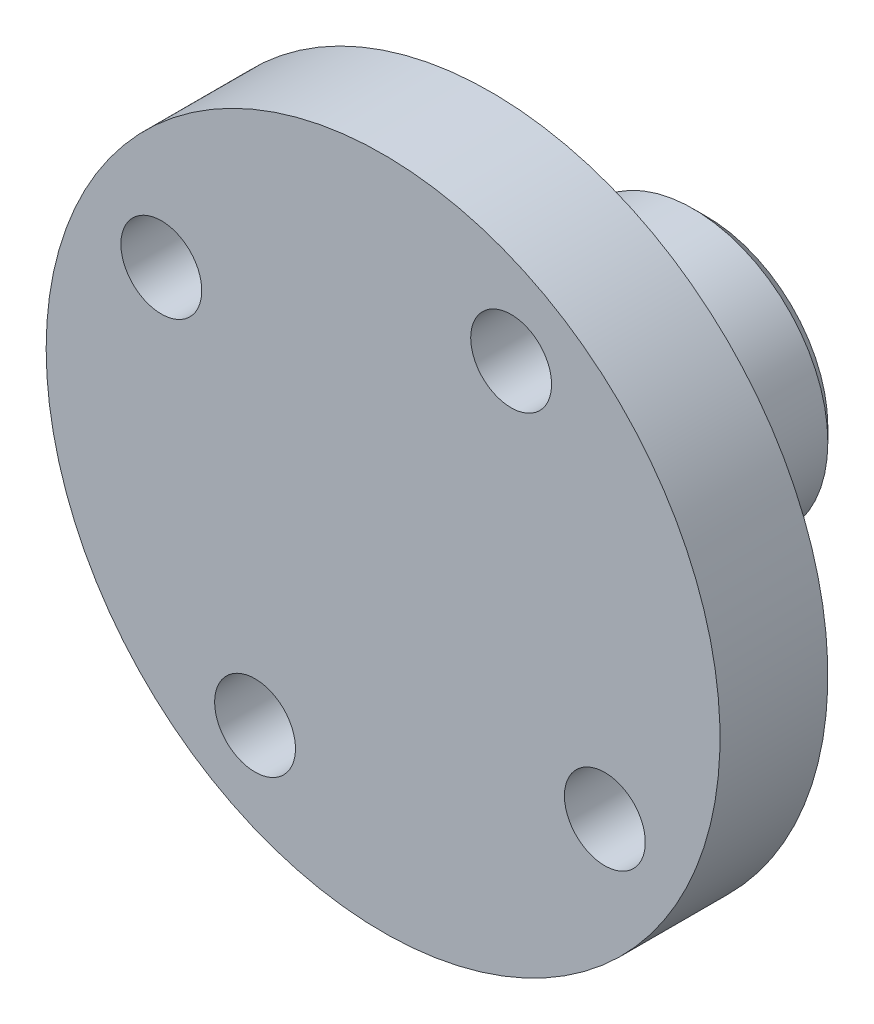
ISO-10303-21;
HEADER;
FILE_DESCRIPTION(('STEP AP214'),'2;1');
FILE_NAME('part.step','',(''),(''),'','','');
FILE_SCHEMA(('AUTOMOTIVE_DESIGN { 1 0 10303 214 1 1 1 1 }'));
ENDSEC;
DATA;
#1=APPLICATION_CONTEXT('core data for automotive mechanical design processes');
#2=APPLICATION_PROTOCOL_DEFINITION('international standard','automotive_design',2000,#1);
#3=PRODUCT_CONTEXT('',#1,'mechanical');
#4=PRODUCT('Part','Part','',(#3));
#5=PRODUCT_RELATED_PRODUCT_CATEGORY('part','',(#4));
#6=PRODUCT_DEFINITION_FORMATION('','',#4);
#7=PRODUCT_DEFINITION_CONTEXT('part definition',#1,'design');
#8=PRODUCT_DEFINITION('design','',#6,#7);
#9=PRODUCT_DEFINITION_SHAPE('','',#8);
#10=(LENGTH_UNIT() NAMED_UNIT(*) SI_UNIT(.MILLI.,.METRE.));
#11=(NAMED_UNIT(*) PLANE_ANGLE_UNIT() SI_UNIT($,.RADIAN.));
#12=(NAMED_UNIT(*) SI_UNIT($,.STERADIAN.) SOLID_ANGLE_UNIT());
#13=UNCERTAINTY_MEASURE_WITH_UNIT(LENGTH_MEASURE(1.E-05),#10,'distance_accuracy_value','');
#14=(GEOMETRIC_REPRESENTATION_CONTEXT(3) GLOBAL_UNCERTAINTY_ASSIGNED_CONTEXT((#13)) GLOBAL_UNIT_ASSIGNED_CONTEXT((#10,
#11,#12)) REPRESENTATION_CONTEXT('',''));
#15=CARTESIAN_POINT('',(0.,0.,0.));
#16=DIRECTION('',(0.,0.,1.));
#17=DIRECTION('',(1.,0.,0.));
#18=AXIS2_PLACEMENT_3D('',#15,#16,#17);
#19=CARTESIAN_POINT('',(12.5,0.,0.));
#20=DIRECTION('',(0.,0.,-1.));
#21=DIRECTION('',(-1.,0.,0.));
#22=AXIS2_PLACEMENT_3D('',#19,#20,#21);
#23=PLANE('',#22);
#24=CARTESIAN_POINT('',(4.75000000000001,8.22724133595215,0.));
#25=DIRECTION('',(0.,0.,-1.));
#26=DIRECTION('',(-1.,0.,0.));
#27=AXIS2_PLACEMENT_3D('',#24,#25,#26);
#28=CIRCLE('',#27,1.5);
#29=CARTESIAN_POINT('',(3.25,8.22724133595215,0.));
#30=VERTEX_POINT('',#29);
#31=EDGE_CURVE('E109',#30,#30,#28,.F.);
#32=ORIENTED_EDGE('',*,*,#31,.F.);
#33=EDGE_LOOP('',(#32));
#34=FACE_BOUND('',#33,.T.);
#35=CARTESIAN_POINT('',(-4.75000000000001,-8.22724133595215,0.));
#36=DIRECTION('',(0.,0.,-1.));
#37=DIRECTION('',(-1.,0.,0.));
#38=AXIS2_PLACEMENT_3D('',#35,#36,#37);
#39=CIRCLE('',#38,1.5);
#40=CARTESIAN_POINT('',(-6.25000000000001,-8.22724133595215,0.));
#41=VERTEX_POINT('',#40);
#42=EDGE_CURVE('E113',#41,#41,#39,.F.);
#43=ORIENTED_EDGE('',*,*,#42,.F.);
#44=EDGE_LOOP('',(#43));
#45=FACE_BOUND('',#44,.T.);
#46=CARTESIAN_POINT('',(-8.22724133595215,4.75,0.));
#47=DIRECTION('',(0.,0.,-1.));
#48=DIRECTION('',(-1.,0.,0.));
#49=AXIS2_PLACEMENT_3D('',#46,#47,#48);
#50=CIRCLE('',#49,1.5);
#51=CARTESIAN_POINT('',(-9.72724133595215,4.75,0.));
#52=VERTEX_POINT('',#51);
#53=EDGE_CURVE('E117',#52,#52,#50,.F.);
#54=ORIENTED_EDGE('',*,*,#53,.F.);
#55=EDGE_LOOP('',(#54));
#56=FACE_BOUND('',#55,.T.);
#57=CARTESIAN_POINT('',(8.22724133595215,-4.75000000000001,0.));
#58=DIRECTION('',(0.,0.,-1.));
#59=DIRECTION('',(-1.,0.,0.));
#60=AXIS2_PLACEMENT_3D('',#57,#58,#59);
#61=CIRCLE('',#60,1.5);
#62=CARTESIAN_POINT('',(6.72724133595215,-4.75000000000001,0.));
#63=VERTEX_POINT('',#62);
#64=EDGE_CURVE('E121',#63,#63,#61,.F.);
#65=ORIENTED_EDGE('',*,*,#64,.F.);
#66=EDGE_LOOP('',(#65));
#67=FACE_BOUND('',#66,.T.);
#68=CARTESIAN_POINT('',(0.,0.,0.));
#69=DIRECTION('',(0.,0.,-1.));
#70=DIRECTION('',(-1.,0.,0.));
#71=AXIS2_PLACEMENT_3D('',#68,#69,#70);
#72=CIRCLE('',#71,12.5);
#73=CARTESIAN_POINT('',(-12.5,0.,0.));
#74=VERTEX_POINT('',#73);
#75=EDGE_CURVE('E124',#74,#74,#72,.T.);
#76=ORIENTED_EDGE('',*,*,#75,.F.);
#77=EDGE_LOOP('',(#76));
#78=FACE_BOUND('',#77,.T.);
#79=ADVANCED_FACE('F34',(#34,#45,#56,#67,#78),#23,.F.);
#80=CARTESIAN_POINT('',(4.,0.,-4.));
#81=DIRECTION('',(0.,0.,1.));
#82=DIRECTION('',(1.,0.,0.));
#83=AXIS2_PLACEMENT_3D('',#80,#81,#82);
#84=PLANE('',#83);
#85=CARTESIAN_POINT('',(0.,0.,-4.));
#86=DIRECTION('',(0.,0.,-1.));
#87=DIRECTION('',(-1.,0.,0.));
#88=AXIS2_PLACEMENT_3D('',#85,#86,#87);
#89=CIRCLE('',#88,4.);
#90=CARTESIAN_POINT('',(-4.,0.,-4.));
#91=VERTEX_POINT('',#90);
#92=EDGE_CURVE('E45',#91,#91,#89,.T.);
#93=ORIENTED_EDGE('',*,*,#92,.T.);
#94=EDGE_LOOP('',(#93));
#95=FACE_BOUND('',#94,.T.);
#96=ADVANCED_FACE('F97',(#95),#84,.F.);
#97=CARTESIAN_POINT('',(0.,0.,0.));
#98=DIRECTION('',(0.,0.,-1.));
#99=DIRECTION('',(-1.,0.,0.));
#100=AXIS2_PLACEMENT_3D('',#97,#98,#99);
#101=CYLINDRICAL_SURFACE('',#100,4.);
#102=CARTESIAN_POINT('',(-4.,0.,-6.5));
#103=CARTESIAN_POINT('',(-4.00000217456151,0.0812350589378529,-6.49999709769689));
#104=CARTESIAN_POINT('',(-3.99750379283184,0.162450241781792,-6.50661976024838));
#105=CARTESIAN_POINT('',(-3.98778696006928,0.322453452352361,-6.53282819526993));
#106=CARTESIAN_POINT('',(-3.98056918893993,0.401241827987616,-6.55241210047057));
#107=CARTESIAN_POINT('',(-3.96218832391545,0.554060784990879,-6.60375300177176));
#108=CARTESIAN_POINT('',(-3.9510328434944,0.628100224162277,-6.63548651682179));
#109=CARTESIAN_POINT('',(-3.92588767765353,0.769799310160253,-6.71010641301582));
#110=CARTESIAN_POINT('',(-3.91189723227548,0.837457239177879,-6.75299578554416));
#111=CARTESIAN_POINT('',(-3.88186246971217,0.967346417045826,-6.85061253107091));
#112=CARTESIAN_POINT('',(-3.86576002583566,1.02927073015119,-6.9057302622594));
#113=CARTESIAN_POINT('',(-3.83360220871327,1.14324421474363,-7.02541043465884));
#114=CARTESIAN_POINT('',(-3.81754685135033,1.19529036359203,-7.08997575608787));
#115=CARTESIAN_POINT('',(-3.78662470617731,1.28998202215985,-7.22971746752321));
#116=CARTESIAN_POINT('',(-3.77182648820818,1.3321939319576,-7.30520436654582));
#117=CARTESIAN_POINT('',(-3.74599860237433,1.40318646334084,-7.46284835416852));
#118=CARTESIAN_POINT('',(-3.73496742975881,1.43197244961239,-7.5450027631551));
#119=CARTESIAN_POINT('',(-3.71854412824136,1.47408431017549,-7.7101167402582));
#120=CARTESIAN_POINT('',(-3.71293924350838,1.48799593218558,-7.79290503843544));
#121=CARTESIAN_POINT('',(-3.70738061461215,1.50179556531648,-7.95981615799384));
#122=CARTESIAN_POINT('',(-3.70742453659304,1.50168936802631,-8.04393841387447));
#123=CARTESIAN_POINT('',(-3.71297511632054,1.48790429610018,-8.20576952521296));
#124=CARTESIAN_POINT('',(-3.71815468871121,1.47503808509004,-8.28356090604418));
#125=CARTESIAN_POINT('',(-3.73284938059529,1.4374416786833,-8.43578715040532));
#126=CARTESIAN_POINT('',(-3.74236515298863,1.41270969663258,-8.51022150661388));
#127=CARTESIAN_POINT('',(-3.76485702190253,1.35163748571904,-8.65527706772823));
#128=CARTESIAN_POINT('',(-3.77789517988166,1.31508648737101,-8.7257994861213));
#129=CARTESIAN_POINT('',(-3.80594210139319,1.23156073762698,-8.85994573759097));
#130=CARTESIAN_POINT('',(-3.82095154457158,1.18458238728897,-8.9235671775197));
#131=CARTESIAN_POINT('',(-3.85248038859113,1.07781780766549,-9.04660366365088));
#132=CARTESIAN_POINT('',(-3.8690334745567,1.01738298716956,-9.10544864074809));
#133=CARTESIAN_POINT('',(-3.90091728164085,0.887312590819021,-9.2123379662058));
#134=CARTESIAN_POINT('',(-3.91624781465952,0.817675603497364,-9.26038065460567));
#135=CARTESIAN_POINT('',(-3.9442639480908,0.66972343699242,-9.34493039706252));
#136=CARTESIAN_POINT('',(-3.95690498259616,0.591290713844719,-9.38124758122106));
#137=CARTESIAN_POINT('',(-3.97778718326962,0.428836850524583,-9.43998260427004));
#138=CARTESIAN_POINT('',(-3.98603030341493,0.344818210845767,-9.46240661656112));
#139=CARTESIAN_POINT('',(-3.99684443228065,0.178375243148665,-9.49162278754194));
#140=CARTESIAN_POINT('',(-3.99969369025686,0.0961036195622094,-9.49918260638251));
#141=CARTESIAN_POINT('',(-4.00025893700126,-0.0685724752550241,-9.50069106389992));
#142=CARTESIAN_POINT('',(-3.99797606386863,-0.150976912983373,-9.49464272031678));
#143=CARTESIAN_POINT('',(-3.98871709772643,-0.310262048561859,-9.46968995769133));
#144=CARTESIAN_POINT('',(-3.98192470962305,-0.387233328007336,-9.45128845626292));
#145=CARTESIAN_POINT('',(-3.96451477091717,-0.536941754957221,-9.40281392745268));
#146=CARTESIAN_POINT('',(-3.9538967228203,-0.609678350347535,-9.37273938205197));
#147=CARTESIAN_POINT('',(-3.92949624407681,-0.751247765110156,-9.30081358756053));
#148=CARTESIAN_POINT('',(-3.91563000209348,-0.819903083557795,-9.25864227077662));
#149=CARTESIAN_POINT('',(-3.88626671564664,-0.949392711726625,-9.16408189682844));
#150=CARTESIAN_POINT('',(-3.87076907009516,-1.01022412027045,-9.11168906745485));
#151=CARTESIAN_POINT('',(-3.83873329490989,-1.12603079874454,-8.99459587787573));
#152=CARTESIAN_POINT('',(-3.82218696503729,-1.18046154123569,-8.9293578172273));
#153=CARTESIAN_POINT('',(-3.79078815746854,-1.27771050031903,-8.79034861529234));
#154=CARTESIAN_POINT('',(-3.77593583194399,-1.32052767414518,-8.7165767086115));
#155=CARTESIAN_POINT('',(-3.74966829822463,-1.39337773518998,-8.56198401322769));
#156=CARTESIAN_POINT('',(-3.73826760328493,-1.42335685446918,-8.48113525408957));
#157=CARTESIAN_POINT('',(-3.72054032891005,-1.46907883466889,-8.31499023631218));
#158=CARTESIAN_POINT('',(-3.71421061057491,-1.48483050305535,-8.22969676380188));
#159=CARTESIAN_POINT('',(-3.70775894792573,-1.50086347097839,-8.06298384045889));
#160=CARTESIAN_POINT('',(-3.70726444523341,-1.50207331495837,-7.98166736828311));
#161=CARTESIAN_POINT('',(-3.71158412745292,-1.49136715641593,-7.82005468372383));
#162=CARTESIAN_POINT('',(-3.71639780898899,-1.47945239850124,-7.73975837532842));
#163=CARTESIAN_POINT('',(-3.73048141585432,-1.44355815630242,-7.58495277328345));
#164=CARTESIAN_POINT('',(-3.73961085376663,-1.41995798316524,-7.51034165375466));
#165=CARTESIAN_POINT('',(-3.76121548297845,-1.3616969677992,-7.36609449150558));
#166=CARTESIAN_POINT('',(-3.77369151995215,-1.32703332944945,-7.29645971192986));
#167=CARTESIAN_POINT('',(-3.80139723903964,-1.24552075938154,-7.16017321030237));
#168=CARTESIAN_POINT('',(-3.81673698440964,-1.1981283280301,-7.09386920320009));
#169=CARTESIAN_POINT('',(-3.84806246757177,-1.09334485729906,-6.9698584390288));
#170=CARTESIAN_POINT('',(-3.86404840943145,-1.03595064012808,-6.91215442521325));
#171=CARTESIAN_POINT('',(-3.89590424609881,-0.909080396784622,-6.80379804417816));
#172=CARTESIAN_POINT('',(-3.91172104900645,-0.839118644212991,-6.75369624656533));
#173=CARTESIAN_POINT('',(-3.9405451445703,-0.691213223200819,-6.66597734472344));
#174=CARTESIAN_POINT('',(-3.95355221851559,-0.61326893409062,-6.62836121226363));
#175=CARTESIAN_POINT('',(-3.9757429260668,-0.447999082002311,-6.56562317095167));
#176=CARTESIAN_POINT('',(-3.98473657158356,-0.360413422234208,-6.5411129353981));
#177=CARTESIAN_POINT('',(-3.99686242179587,-0.181875733606382,-6.50830704007932));
#178=CARTESIAN_POINT('',(-3.99999756603967,-0.090925416364859,-6.50000324851268));
#179=CARTESIAN_POINT('',(-4.,0.,-6.5));
#180=B_SPLINE_CURVE_WITH_KNOTS('',3,(#102,#103,#104,#105,#106,#107,#108,#109,#110,#111,#112,
#113,#114,#115,#116,#117,#118,#119,#120,#121,#122,#123,#124,#125,#126,#127,#128,#129,#130,#131,
#132,#133,#134,#135,#136,#137,#138,#139,#140,#141,#142,#143,#144,#145,#146,#147,#148,#149,#150,
#151,#152,#153,#154,#155,#156,#157,#158,#159,#160,#161,#162,#163,#164,#165,#166,#167,#168,#169,
#170,#171,#172,#173,#174,#175,#176,#177,#178,#179),.UNSPECIFIED.,.T.,.F.,(4,2,2,2,2,2,2,2,2,2,2,
2,2,2,2,2,2,2,2,2,2,2,2,2,2,2,2,2,2,2,2,2,2,2,2,2,2,2,4),(0.,0.24336980156056,0.48670454953046,
0.729571369213573,0.97250337960949,1.22473618582715,1.47704604925622,1.73896674501659,
2.00078269352134,2.25185874416901,2.50283106079707,2.73878345119971,2.97477138060589,
3.21522408387018,3.45575990744259,3.71246153335813,3.96920257905066,4.22991375286075,
4.49050899698846,4.73725019635926,4.98393668390521,5.2211443792384,5.45838293254454,
5.702592218596,5.94689180019868,6.20536519455658,6.46386178920141,6.72343066727204,
6.98283874956507,7.22558763480252,7.46831350211259,7.70363142426534,7.93900886656507,
8.18672471884271,8.43451941997062,8.69572329654039,8.95694749805102,9.22948515032042,
9.50188601796128),.UNSPECIFIED.);
#181=CARTESIAN_POINT('',(-4.,0.,-6.5));
#182=VERTEX_POINT('',#181);
#183=EDGE_CURVE('E87',#182,#182,#180,.T.);
#184=ORIENTED_EDGE('',*,*,#183,.T.);
#185=EDGE_LOOP('',(#184));
#186=FACE_BOUND('',#185,.T.);
#187=CARTESIAN_POINT('',(4.,0.,-9.5));
#188=CARTESIAN_POINT('',(4.00000217456151,0.0812350589378529,-9.50000290230311));
#189=CARTESIAN_POINT('',(3.99750379283184,0.162450241781792,-9.49338023975162));
#190=CARTESIAN_POINT('',(3.98778696006928,0.322453452352361,-9.46717180473007));
#191=CARTESIAN_POINT('',(3.98056918893993,0.401241827987616,-9.44758789952943));
#192=CARTESIAN_POINT('',(3.96218832391545,0.554060784990879,-9.39624699822824));
#193=CARTESIAN_POINT('',(3.9510328434944,0.628100224162277,-9.36451348317821));
#194=CARTESIAN_POINT('',(3.92588767765353,0.769799310160253,-9.28989358698418));
#195=CARTESIAN_POINT('',(3.91189723227548,0.837457239177879,-9.24700421445585));
#196=CARTESIAN_POINT('',(3.88186246971217,0.967346417045826,-9.14938746892909));
#197=CARTESIAN_POINT('',(3.86576002583566,1.02927073015119,-9.0942697377406));
#198=CARTESIAN_POINT('',(3.83360220871327,1.14324421474363,-8.97458956534116));
#199=CARTESIAN_POINT('',(3.81754685135033,1.19529036359203,-8.91002424391213));
#200=CARTESIAN_POINT('',(3.78662470617731,1.28998202215985,-8.77028253247679));
#201=CARTESIAN_POINT('',(3.77182648820818,1.3321939319576,-8.69479563345418));
#202=CARTESIAN_POINT('',(3.74599860237433,1.40318646334084,-8.53715164583148));
#203=CARTESIAN_POINT('',(3.73496742975881,1.43197244961239,-8.4549972368449));
#204=CARTESIAN_POINT('',(3.71854412824136,1.47408431017549,-8.2898832597418));
#205=CARTESIAN_POINT('',(3.71293924350838,1.48799593218558,-8.20709496156456));
#206=CARTESIAN_POINT('',(3.70738061461215,1.50179556531648,-8.04018384200616));
#207=CARTESIAN_POINT('',(3.70742453659304,1.50168936802631,-7.95606158612553));
#208=CARTESIAN_POINT('',(3.71297511632054,1.48790429610018,-7.79423047478705));
#209=CARTESIAN_POINT('',(3.71815468871121,1.47503808509004,-7.71643909395582));
#210=CARTESIAN_POINT('',(3.73284938059529,1.4374416786833,-7.56421284959468));
#211=CARTESIAN_POINT('',(3.74236515298863,1.41270969663258,-7.48977849338612));
#212=CARTESIAN_POINT('',(3.76485702190253,1.35163748571904,-7.34472293227177));
#213=CARTESIAN_POINT('',(3.77789517988166,1.31508648737101,-7.2742005138787));
#214=CARTESIAN_POINT('',(3.80594210139319,1.23156073762698,-7.14005426240903));
#215=CARTESIAN_POINT('',(3.82095154457158,1.18458238728897,-7.0764328224803));
#216=CARTESIAN_POINT('',(3.85248038859113,1.07781780766549,-6.95339633634912));
#217=CARTESIAN_POINT('',(3.8690334745567,1.01738298716956,-6.89455135925191));
#218=CARTESIAN_POINT('',(3.90091728164085,0.887312590819021,-6.7876620337942));
#219=CARTESIAN_POINT('',(3.91624781465952,0.817675603497364,-6.73961934539433));
#220=CARTESIAN_POINT('',(3.9442639480908,0.669723436992419,-6.65506960293748));
#221=CARTESIAN_POINT('',(3.95690498259616,0.591290713844719,-6.61875241877894));
#222=CARTESIAN_POINT('',(3.97778718326962,0.428836850524583,-6.56001739572996));
#223=CARTESIAN_POINT('',(3.98603030341493,0.344818210845768,-6.53759338343888));
#224=CARTESIAN_POINT('',(3.99684443228065,0.178375243148666,-6.50837721245806));
#225=CARTESIAN_POINT('',(3.99969369025686,0.0961036195622096,-6.50081739361749));
#226=CARTESIAN_POINT('',(4.00025893700126,-0.0685724752550242,-6.49930893610008));
#227=CARTESIAN_POINT('',(3.99797606386863,-0.150976912983373,-6.50535727968322));
#228=CARTESIAN_POINT('',(3.98871709772643,-0.310262048561859,-6.53031004230867));
#229=CARTESIAN_POINT('',(3.98192470962305,-0.387233328007336,-6.54871154373709));
#230=CARTESIAN_POINT('',(3.96451477091717,-0.536941754957221,-6.59718607254732));
#231=CARTESIAN_POINT('',(3.9538967228203,-0.609678350347534,-6.62726061794803));
#232=CARTESIAN_POINT('',(3.92949624407681,-0.751247765110156,-6.69918641243947));
#233=CARTESIAN_POINT('',(3.91563000209348,-0.819903083557796,-6.74135772922338));
#234=CARTESIAN_POINT('',(3.88626671564664,-0.949392711726626,-6.83591810317156));
#235=CARTESIAN_POINT('',(3.87076907009516,-1.01022412027045,-6.88831093254515));
#236=CARTESIAN_POINT('',(3.83873329490989,-1.12603079874454,-7.00540412212427));
#237=CARTESIAN_POINT('',(3.82218696503729,-1.18046154123569,-7.0706421827727));
#238=CARTESIAN_POINT('',(3.79078815746853,-1.27771050031903,-7.20965138470766));
#239=CARTESIAN_POINT('',(3.77593583194399,-1.32052767414518,-7.2834232913885));
#240=CARTESIAN_POINT('',(3.74966829822463,-1.39337773518998,-7.43801598677231));
#241=CARTESIAN_POINT('',(3.73826760328493,-1.42335685446918,-7.51886474591044));
#242=CARTESIAN_POINT('',(3.72054032891005,-1.46907883466889,-7.68500976368782));
#243=CARTESIAN_POINT('',(3.71421061057491,-1.48483050305535,-7.77030323619812));
#244=CARTESIAN_POINT('',(3.70775894792573,-1.50086347097839,-7.93701615954111));
#245=CARTESIAN_POINT('',(3.70726444523341,-1.50207331495837,-8.01833263171689));
#246=CARTESIAN_POINT('',(3.71158412745292,-1.49136715641593,-8.17994531627617));
#247=CARTESIAN_POINT('',(3.71639780898899,-1.47945239850124,-8.26024162467158));
#248=CARTESIAN_POINT('',(3.73048141585432,-1.44355815630242,-8.41504722671655));
#249=CARTESIAN_POINT('',(3.73961085376663,-1.41995798316524,-8.48965834624535));
#250=CARTESIAN_POINT('',(3.76121548297845,-1.3616969677992,-8.63390550849442));
#251=CARTESIAN_POINT('',(3.77369151995215,-1.32703332944945,-8.70354028807014));
#252=CARTESIAN_POINT('',(3.80139723903964,-1.24552075938154,-8.83982678969763));
#253=CARTESIAN_POINT('',(3.81673698440964,-1.1981283280301,-8.90613079679991));
#254=CARTESIAN_POINT('',(3.84806246757177,-1.09334485729906,-9.03014156097121));
#255=CARTESIAN_POINT('',(3.86404840943145,-1.03595064012808,-9.08784557478675));
#256=CARTESIAN_POINT('',(3.89590424609881,-0.909080396784624,-9.19620195582184));
#257=CARTESIAN_POINT('',(3.91172104900645,-0.839118644212992,-9.24630375343467));
#258=CARTESIAN_POINT('',(3.9405451445703,-0.69121322320082,-9.33402265527656));
#259=CARTESIAN_POINT('',(3.95355221851559,-0.613268934090621,-9.37163878773637));
#260=CARTESIAN_POINT('',(3.9757429260668,-0.447999082002312,-9.43437682904833));
#261=CARTESIAN_POINT('',(3.98473657158356,-0.360413422234208,-9.4588870646019));
#262=CARTESIAN_POINT('',(3.99686242179587,-0.181875733606382,-9.49169295992068));
#263=CARTESIAN_POINT('',(3.99999756603967,-0.0909254163648589,-9.49999675148732));
#264=CARTESIAN_POINT('',(4.,0.,-9.5));
#265=B_SPLINE_CURVE_WITH_KNOTS('',3,(#187,#188,#189,#190,#191,#192,#193,#194,#195,#196,#197,
#198,#199,#200,#201,#202,#203,#204,#205,#206,#207,#208,#209,#210,#211,#212,#213,#214,#215,#216,
#217,#218,#219,#220,#221,#222,#223,#224,#225,#226,#227,#228,#229,#230,#231,#232,#233,#234,#235,
#236,#237,#238,#239,#240,#241,#242,#243,#244,#245,#246,#247,#248,#249,#250,#251,#252,#253,#254,
#255,#256,#257,#258,#259,#260,#261,#262,#263,#264),.UNSPECIFIED.,.T.,.F.,(4,2,2,2,2,2,2,2,2,2,2,
2,2,2,2,2,2,2,2,2,2,2,2,2,2,2,2,2,2,2,2,2,2,2,2,2,2,2,4),(0.,0.24336980156056,0.48670454953046,
0.729571369213573,0.97250337960949,1.22473618582716,1.47704604925622,1.73896674501659,
2.00078269352134,2.25185874416901,2.50283106079707,2.73878345119971,2.97477138060589,
3.21522408387018,3.45575990744259,3.71246153335813,3.96920257905066,4.22991375286075,
4.49050899698846,4.73725019635926,4.98393668390521,5.2211443792384,5.45838293254454,
5.702592218596,5.94689180019868,6.20536519455658,6.46386178920141,6.72343066727204,
6.98283874956507,7.22558763480253,7.46831350211259,7.70363142426534,7.93900886656507,
8.18672471884271,8.43451941997062,8.69572329654039,8.95694749805103,9.22948515032043,
9.50188601796128),.UNSPECIFIED.);
#266=CARTESIAN_POINT('',(4.,0.,-9.5));
#267=VERTEX_POINT('',#266);
#268=EDGE_CURVE('E60',#267,#267,#265,.T.);
#269=ORIENTED_EDGE('',*,*,#268,.T.);
#270=EDGE_LOOP('',(#269));
#271=FACE_BOUND('',#270,.T.);
#272=ORIENTED_EDGE('',*,*,#92,.F.);
#273=EDGE_LOOP('',(#272));
#274=FACE_BOUND('',#273,.T.);
#275=CARTESIAN_POINT('',(0.,0.,-12.));
#276=DIRECTION('',(0.,0.,-1.));
#277=DIRECTION('',(-1.,0.,0.));
#278=AXIS2_PLACEMENT_3D('',#275,#276,#277);
#279=CIRCLE('',#278,4.);
#280=CARTESIAN_POINT('',(-4.,0.,-12.));
#281=VERTEX_POINT('',#280);
#282=EDGE_CURVE('E49',#281,#281,#279,.T.);
#283=ORIENTED_EDGE('',*,*,#282,.T.);
#284=EDGE_LOOP('',(#283));
#285=FACE_BOUND('',#284,.T.);
#286=ADVANCED_FACE('F92',(#186,#271,#274,#285),#101,.F.);
#287=CARTESIAN_POINT('',(4.,0.,-12.));
#288=DIRECTION('',(0.,0.,1.));
#289=DIRECTION('',(1.,0.,0.));
#290=AXIS2_PLACEMENT_3D('',#287,#288,#289);
#291=PLANE('',#290);
#292=CARTESIAN_POINT('',(0.,0.,-12.));
#293=DIRECTION('',(0.,0.,1.));
#294=DIRECTION('',(1.,0.,0.));
#295=AXIS2_PLACEMENT_3D('',#292,#293,#294);
#296=CIRCLE('',#295,4.5);
#297=CARTESIAN_POINT('',(4.5,0.,-12.));
#298=VERTEX_POINT('',#297);
#299=EDGE_CURVE('E41',#298,#298,#296,.F.);
#300=ORIENTED_EDGE('',*,*,#299,.T.);
#301=EDGE_LOOP('',(#300));
#302=FACE_BOUND('',#301,.T.);
#303=ORIENTED_EDGE('',*,*,#282,.F.);
#304=EDGE_LOOP('',(#303));
#305=FACE_BOUND('',#304,.T.);
#306=ADVANCED_FACE('F96',(#302,#305),#291,.F.);
#307=CARTESIAN_POINT('',(0.,0.,0.));
#308=DIRECTION('',(0.,0.,-1.));
#309=DIRECTION('',(-1.,0.,0.));
#310=AXIS2_PLACEMENT_3D('',#307,#308,#309);
#311=CYLINDRICAL_SURFACE('',#310,5.);
#312=CARTESIAN_POINT('',(0.,0.,-11.5));
#313=DIRECTION('',(0.,0.,1.));
#314=DIRECTION('',(1.,0.,0.));
#315=AXIS2_PLACEMENT_3D('',#312,#313,#314);
#316=CIRCLE('',#315,5.);
#317=CARTESIAN_POINT('',(5.,0.,-11.5));
#318=VERTEX_POINT('',#317);
#319=EDGE_CURVE('E10',#318,#318,#316,.T.);
#320=ORIENTED_EDGE('',*,*,#319,.T.);
#321=EDGE_LOOP('',(#320));
#322=FACE_BOUND('',#321,.T.);
#323=CARTESIAN_POINT('',(-5.,0.,-6.5));
#324=CARTESIAN_POINT('',(-4.99999929250549,-0.0822886127532999,-6.50000099748489));
#325=CARTESIAN_POINT('',(-4.99794915693953,-0.164587318351529,-6.50679386362397));
#326=CARTESIAN_POINT('',(-4.98997105593691,-0.326788125304881,-6.5337213542221));
#327=CARTESIAN_POINT('',(-4.98404193389692,-0.40668950441142,-6.55385995802334));
#328=CARTESIAN_POINT('',(-4.96895552501836,-0.561732707754526,-6.60674601691026));
#329=CARTESIAN_POINT('',(-4.95980300250425,-0.636881364395372,-6.63947486961894));
#330=CARTESIAN_POINT('',(-4.93922109237645,-0.780624181053131,-6.71653609305584));
#331=CARTESIAN_POINT('',(-4.92779140192066,-0.849217467469669,-6.76087000739542));
#332=CARTESIAN_POINT('',(-4.90350737192774,-0.979871797183745,-6.86122400747267));
#333=CARTESIAN_POINT('',(-4.89062383657036,-1.04171807124434,-6.91751662588591));
#334=CARTESIAN_POINT('',(-4.86505834210442,-1.15524920923324,-7.03960922991018));
#335=CARTESIAN_POINT('',(-4.85237641724501,-1.20693236327441,-7.10541081212496));
#336=CARTESIAN_POINT('',(-4.82834113993772,-1.29980037723708,-7.24647075303761));
#337=CARTESIAN_POINT('',(-4.81702406663875,-1.34072309022213,-7.32190846099074));
#338=CARTESIAN_POINT('',(-4.79743620394031,-1.4092139477476,-7.47898925423029));
#339=CARTESIAN_POINT('',(-4.7891646831331,-1.43678529919973,-7.56063084392798));
#340=CARTESIAN_POINT('',(-4.77690870838434,-1.47701633682652,-7.72539026613046));
#341=CARTESIAN_POINT('',(-4.77281069324533,-1.49007196234677,-7.80840274386394));
#342=CARTESIAN_POINT('',(-4.76902789749767,-1.50213730614672,-7.97553315621676));
#343=CARTESIAN_POINT('',(-4.76934204760571,-1.50115042761078,-8.05965081805908));
#344=CARTESIAN_POINT('',(-4.77424744067778,-1.48546977199812,-8.22338390860848));
#345=CARTESIAN_POINT('',(-4.7786838859914,-1.47127205262685,-8.30305225036224));
#346=CARTESIAN_POINT('',(-4.79108356228624,-1.43037420427056,-8.45881978627346));
#347=CARTESIAN_POINT('',(-4.7990471413235,-1.40367284141641,-8.53491862737433));
#348=CARTESIAN_POINT('',(-4.81772733074973,-1.33816026653682,-8.68260034966074));
#349=CARTESIAN_POINT('',(-4.82848016115952,-1.29918816934643,-8.75410708395526));
#350=CARTESIAN_POINT('',(-4.85150987000064,-1.21035222588683,-8.88973202201019));
#351=CARTESIAN_POINT('',(-4.86378711746991,-1.16048574002588,-8.95384842941378));
#352=CARTESIAN_POINT('',(-4.88911011297937,-1.04881290765546,-9.07568619076202));
#353=CARTESIAN_POINT('',(-4.90216654310498,-0.986594907466973,-9.13302866402967));
#354=CARTESIAN_POINT('',(-4.92712244063258,-0.853263259313968,-9.23655398406425));
#355=CARTESIAN_POINT('',(-4.9390218351841,-0.782149051860889,-9.28273612841443));
#356=CARTESIAN_POINT('',(-4.9604316006947,-0.632355038342804,-9.36285992246473));
#357=CARTESIAN_POINT('',(-4.96992543668314,-0.553627749747951,-9.39671751624986));
#358=CARTESIAN_POINT('',(-4.98533521832222,-0.391245415603519,-9.45059959009963));
#359=CARTESIAN_POINT('',(-4.99125216186999,-0.307591751589582,-9.47062792853249));
#360=CARTESIAN_POINT('',(-4.99868364643538,-0.140952242668332,-9.49565217789939));
#361=CARTESIAN_POINT('',(-5.0003485041779,-0.0580500976011869,-9.50116158580161));
#362=CARTESIAN_POINT('',(-4.99952923241759,0.107499605823383,-9.49843084428792));
#363=CARTESIAN_POINT('',(-4.99704565677756,0.19014719669078,-9.49019253034856));
#364=CARTESIAN_POINT('',(-4.98830696987163,0.350903605309696,-9.4606153888885));
#365=CARTESIAN_POINT('',(-4.98213829799417,0.429072772614169,-9.43957661241913));
#366=CARTESIAN_POINT('',(-4.96674347841532,0.580754638954521,-9.3853567672218));
#367=CARTESIAN_POINT('',(-4.95751696321085,0.654266777025583,-9.35217423896214));
#368=CARTESIAN_POINT('',(-4.93669654351324,0.796437189461052,-9.27374683451887));
#369=CARTESIAN_POINT('',(-4.92505280829675,0.864943826199669,-9.22824065905203));
#370=CARTESIAN_POINT('',(-4.90073468764317,0.993523307980147,-9.12677524594719));
#371=CARTESIAN_POINT('',(-4.8880600443108,1.05359403235593,-9.07081338811233));
#372=CARTESIAN_POINT('',(-4.86253171869138,1.16585744551027,-8.94761269163065));
#373=CARTESIAN_POINT('',(-4.84968825033267,1.21768481231504,-8.88003812422826));
#374=CARTESIAN_POINT('',(-4.82576515238463,1.30928995072154,-8.73687206098647));
#375=CARTESIAN_POINT('',(-4.81468547654651,1.34906803829472,-8.66128077544178));
#376=CARTESIAN_POINT('',(-4.79567189615055,1.41517347127168,-8.50446750874531));
#377=CARTESIAN_POINT('',(-4.78772337843827,1.4415634693705,-8.42327381346341));
#378=CARTESIAN_POINT('',(-4.77591594362794,1.48021730815114,-8.25731203106852));
#379=CARTESIAN_POINT('',(-4.772055625083,1.49248598978779,-8.17254517921233));
#380=CARTESIAN_POINT('',(-4.76899972496087,1.50221984485059,-8.00563848162377));
#381=CARTESIAN_POINT('',(-4.76961647442754,1.5002805530849,-7.92353634898242));
#382=CARTESIAN_POINT('',(-4.77499401288294,1.48307505444813,-7.7608858966272));
#383=CARTESIAN_POINT('',(-4.77975463592551,1.46780938124716,-7.68033751482365));
#384=CARTESIAN_POINT('',(-4.79275763670385,1.42476888804136,-7.52405460085715));
#385=CARTESIAN_POINT('',(-4.80095604545964,1.39715175507069,-7.44827271263831));
#386=CARTESIAN_POINT('',(-4.81990278909136,1.33031507121129,-7.30235756118228));
#387=CARTESIAN_POINT('',(-4.83065161194312,1.29109329962876,-7.23222538235924));
#388=CARTESIAN_POINT('',(-4.85397676425833,1.20048763805072,-7.09683688347289));
#389=CARTESIAN_POINT('',(-4.86660540163797,1.14871276092994,-7.03185123873959));
#390=CARTESIAN_POINT('',(-4.89201320450026,1.03517434629782,-6.91129750169214));
#391=CARTESIAN_POINT('',(-4.90479240823905,0.973408217134503,-6.85573186053224));
#392=CARTESIAN_POINT('',(-4.92950936570649,0.83946576218325,-6.75397658770497));
#393=CARTESIAN_POINT('',(-4.94141159765674,0.767037885790609,-6.70810855314451));
#394=CARTESIAN_POINT('',(-4.96260680455813,0.615141373983531,-6.62926483009598));
#395=CARTESIAN_POINT('',(-4.97190099931066,0.535676052998956,-6.59628311172549));
#396=CARTESIAN_POINT('',(-4.98602174969301,0.380757712655282,-6.54710472434725));
#397=CARTESIAN_POINT('',(-4.99122027381067,0.305786961954234,-6.52948832711675));
#398=CARTESIAN_POINT('',(-4.99820944494492,0.15388019523078,-6.50593647475842));
#399=CARTESIAN_POINT('',(-5.0000006615474,0.0769445098581396,-6.49999906729518));
#400=CARTESIAN_POINT('',(-5.,0.,-6.5));
#401=B_SPLINE_CURVE_WITH_KNOTS('',3,(#323,#324,#325,#326,#327,#328,#329,#330,#331,#332,#333,
#334,#335,#336,#337,#338,#339,#340,#341,#342,#343,#344,#345,#346,#347,#348,#349,#350,#351,#352,
#353,#354,#355,#356,#357,#358,#359,#360,#361,#362,#363,#364,#365,#366,#367,#368,#369,#370,#371,
#372,#373,#374,#375,#376,#377,#378,#379,#380,#381,#382,#383,#384,#385,#386,#387,#388,#389,#390,
#391,#392,#393,#394,#395,#396,#397,#398,#399,#400),.UNSPECIFIED.,.T.,.F.,(4,2,2,2,2,2,2,2,2,2,2,
2,2,2,2,2,2,2,2,2,2,2,2,2,2,2,2,2,2,2,2,2,2,2,2,2,2,2,4),(0.,0.24658320361261,0.493239964845999,
0.739533676300874,0.985860164412701,1.23855602948191,1.49129437288633,1.74971481004109,
2.00807314543224,2.25919689356599,2.51025978319089,2.75226016697676,2.99428443658001,
3.23962426447119,3.48502360158555,3.74067104048167,3.99633456531071,4.25371046881689,
4.51101453528808,4.75908809438545,5.00712853550327,5.24956746682327,5.49203554593729,
5.74011305702908,5.98825282000191,6.24540400322819,6.50254844252681,6.75847814951252,
7.01432009460283,7.25950155466943,7.504673196616,7.74680040402721,7.98897397553107,
8.23996925679931,8.49102974897502,8.74942996156671,9.00770911595235,9.2383169193046,
9.46888616948875),.UNSPECIFIED.);
#402=CARTESIAN_POINT('',(-5.,0.,-6.5));
#403=VERTEX_POINT('',#402);
#404=EDGE_CURVE('E52',#403,#403,#401,.T.);
#405=ORIENTED_EDGE('',*,*,#404,.T.);
#406=EDGE_LOOP('',(#405));
#407=FACE_BOUND('',#406,.T.);
#408=CARTESIAN_POINT('',(5.,0.,-9.5));
#409=CARTESIAN_POINT('',(4.99999929250549,-0.0822886127533,-9.49999900251512));
#410=CARTESIAN_POINT('',(4.99794915693953,-0.164587318351529,-9.49320613637604));
#411=CARTESIAN_POINT('',(4.98997105593691,-0.326788125304881,-9.4662786457779));
#412=CARTESIAN_POINT('',(4.98404193389692,-0.40668950441142,-9.44614004197666));
#413=CARTESIAN_POINT('',(4.96895552501836,-0.561732707754527,-9.39325398308974));
#414=CARTESIAN_POINT('',(4.95980300250425,-0.636881364395373,-9.36052513038106));
#415=CARTESIAN_POINT('',(4.93922109237645,-0.780624181053132,-9.28346390694416));
#416=CARTESIAN_POINT('',(4.92779140192066,-0.84921746746967,-9.23912999260458));
#417=CARTESIAN_POINT('',(4.90350737192774,-0.979871797183746,-9.13877599252733));
#418=CARTESIAN_POINT('',(4.89062383657036,-1.04171807124434,-9.08248337411409));
#419=CARTESIAN_POINT('',(4.86505834210442,-1.15524920923324,-8.96039077008981));
#420=CARTESIAN_POINT('',(4.85237641724501,-1.20693236327441,-8.89458918787504));
#421=CARTESIAN_POINT('',(4.82834113993772,-1.29980037723708,-8.75352924696239));
#422=CARTESIAN_POINT('',(4.81702406663874,-1.34072309022214,-8.67809153900926));
#423=CARTESIAN_POINT('',(4.79743620394031,-1.4092139477476,-8.52101074576971));
#424=CARTESIAN_POINT('',(4.7891646831331,-1.43678529919973,-8.43936915607203));
#425=CARTESIAN_POINT('',(4.77690870838434,-1.47701633682652,-8.27460973386954));
#426=CARTESIAN_POINT('',(4.77281069324533,-1.49007196234677,-8.19159725613606));
#427=CARTESIAN_POINT('',(4.76902789749767,-1.50213730614672,-8.02446684378323));
#428=CARTESIAN_POINT('',(4.76934204760571,-1.50115042761078,-7.94034918194091));
#429=CARTESIAN_POINT('',(4.77424744067778,-1.48546977199812,-7.77661609139152));
#430=CARTESIAN_POINT('',(4.7786838859914,-1.47127205262685,-7.69694774963776));
#431=CARTESIAN_POINT('',(4.79108356228624,-1.43037420427056,-7.54118021372654));
#432=CARTESIAN_POINT('',(4.7990471413235,-1.40367284141641,-7.46508137262567));
#433=CARTESIAN_POINT('',(4.81772733074973,-1.33816026653682,-7.31739965033926));
#434=CARTESIAN_POINT('',(4.82848016115952,-1.29918816934643,-7.24589291604474));
#435=CARTESIAN_POINT('',(4.85150987000064,-1.21035222588683,-7.11026797798981));
#436=CARTESIAN_POINT('',(4.86378711746991,-1.16048574002588,-7.04615157058622));
#437=CARTESIAN_POINT('',(4.88911011297937,-1.04881290765546,-6.92431380923798));
#438=CARTESIAN_POINT('',(4.90216654310498,-0.986594907466972,-6.86697133597033));
#439=CARTESIAN_POINT('',(4.92712244063258,-0.853263259313967,-6.76344601593575));
#440=CARTESIAN_POINT('',(4.9390218351841,-0.782149051860888,-6.71726387158557));
#441=CARTESIAN_POINT('',(4.9604316006947,-0.632355038342803,-6.63714007753527));
#442=CARTESIAN_POINT('',(4.96992543668314,-0.553627749747951,-6.60328248375014));
#443=CARTESIAN_POINT('',(4.98533521832222,-0.391245415603519,-6.54940040990037));
#444=CARTESIAN_POINT('',(4.99125216186999,-0.307591751589582,-6.52937207146751));
#445=CARTESIAN_POINT('',(4.99868364643538,-0.140952242668332,-6.50434782210061));
#446=CARTESIAN_POINT('',(5.0003485041779,-0.0580500976011868,-6.49883841419839));
#447=CARTESIAN_POINT('',(4.99952923241759,0.107499605823383,-6.50156915571208));
#448=CARTESIAN_POINT('',(4.99704565677756,0.190147196690781,-6.50980746965144));
#449=CARTESIAN_POINT('',(4.98830696987163,0.350903605309697,-6.53938461111149));
#450=CARTESIAN_POINT('',(4.98213829799417,0.429072772614169,-6.56042338758087));
#451=CARTESIAN_POINT('',(4.96674347841532,0.580754638954522,-6.6146432327782));
#452=CARTESIAN_POINT('',(4.95751696321085,0.654266777025584,-6.64782576103786));
#453=CARTESIAN_POINT('',(4.93669654351324,0.796437189461053,-6.72625316548113));
#454=CARTESIAN_POINT('',(4.92505280829675,0.86494382619967,-6.77175934094797));
#455=CARTESIAN_POINT('',(4.90073468764317,0.993523307980147,-6.87322475405281));
#456=CARTESIAN_POINT('',(4.8880600443108,1.05359403235594,-6.92918661188767));
#457=CARTESIAN_POINT('',(4.86253171869138,1.16585744551027,-7.05238730836934));
#458=CARTESIAN_POINT('',(4.84968825033267,1.21768481231504,-7.11996187577174));
#459=CARTESIAN_POINT('',(4.82576515238463,1.30928995072154,-7.26312793901353));
#460=CARTESIAN_POINT('',(4.81468547654651,1.34906803829472,-7.33871922455821));
#461=CARTESIAN_POINT('',(4.79567189615055,1.41517347127168,-7.49553249125469));
#462=CARTESIAN_POINT('',(4.78772337843827,1.4415634693705,-7.57672618653659));
#463=CARTESIAN_POINT('',(4.77591594362794,1.48021730815114,-7.74268796893148));
#464=CARTESIAN_POINT('',(4.772055625083,1.49248598978779,-7.82745482078767));
#465=CARTESIAN_POINT('',(4.76899972496087,1.50221984485059,-7.99436151837623));
#466=CARTESIAN_POINT('',(4.76961647442754,1.5002805530849,-8.07646365101759));
#467=CARTESIAN_POINT('',(4.77499401288294,1.48307505444813,-8.2391141033728));
#468=CARTESIAN_POINT('',(4.77975463592551,1.46780938124716,-8.31966248517635));
#469=CARTESIAN_POINT('',(4.79275763670385,1.42476888804136,-8.47594539914285));
#470=CARTESIAN_POINT('',(4.80095604545964,1.39715175507068,-8.55172728736169));
#471=CARTESIAN_POINT('',(4.81990278909136,1.33031507121129,-8.69764243881772));
#472=CARTESIAN_POINT('',(4.83065161194312,1.29109329962876,-8.76777461764076));
#473=CARTESIAN_POINT('',(4.85397676425833,1.20048763805072,-8.90316311652711));
#474=CARTESIAN_POINT('',(4.86660540163797,1.14871276092994,-8.96814876126041));
#475=CARTESIAN_POINT('',(4.89201320450026,1.03517434629782,-9.08870249830786));
#476=CARTESIAN_POINT('',(4.90479240823905,0.973408217134501,-9.14426813946776));
#477=CARTESIAN_POINT('',(4.92950936570649,0.839465762183248,-9.24602341229503));
#478=CARTESIAN_POINT('',(4.94141159765674,0.767037885790607,-9.29189144685549));
#479=CARTESIAN_POINT('',(4.96260680455813,0.615141373983529,-9.37073516990403));
#480=CARTESIAN_POINT('',(4.97190099931066,0.535676052998954,-9.40371688827451));
#481=CARTESIAN_POINT('',(4.98602174969301,0.380757712655281,-9.45289527565275));
#482=CARTESIAN_POINT('',(4.99122027381067,0.305786961954234,-9.47051167288325));
#483=CARTESIAN_POINT('',(4.99820944494492,0.153880195230779,-9.49406352524158));
#484=CARTESIAN_POINT('',(5.0000006615474,0.0769445098581395,-9.50000093270482));
#485=CARTESIAN_POINT('',(5.,0.,-9.5));
#486=B_SPLINE_CURVE_WITH_KNOTS('',3,(#408,#409,#410,#411,#412,#413,#414,#415,#416,#417,#418,
#419,#420,#421,#422,#423,#424,#425,#426,#427,#428,#429,#430,#431,#432,#433,#434,#435,#436,#437,
#438,#439,#440,#441,#442,#443,#444,#445,#446,#447,#448,#449,#450,#451,#452,#453,#454,#455,#456,
#457,#458,#459,#460,#461,#462,#463,#464,#465,#466,#467,#468,#469,#470,#471,#472,#473,#474,#475,
#476,#477,#478,#479,#480,#481,#482,#483,#484,#485),.UNSPECIFIED.,.T.,.F.,(4,2,2,2,2,2,2,2,2,2,2,
2,2,2,2,2,2,2,2,2,2,2,2,2,2,2,2,2,2,2,2,2,2,2,2,2,2,2,4),(0.,0.246583203612611,0.493239964846,
0.739533676300875,0.985860164412702,1.23855602948192,1.49129437288633,1.74971481004109,
2.00807314543224,2.25919689356599,2.51025978319089,2.75226016697676,2.99428443658001,
3.2396242644712,3.48502360158556,3.74067104048167,3.99633456531072,4.25371046881689,
4.51101453528808,4.75908809438545,5.00712853550327,5.24956746682327,5.49203554593729,
5.74011305702908,5.98825282000191,6.24540400322819,6.50254844252681,6.75847814951252,
7.01432009460283,7.25950155466943,7.504673196616,7.74680040402721,7.98897397553107,
8.23996925679931,8.49102974897503,8.74942996156671,9.00770911595236,9.2383169193046,
9.46888616948875),.UNSPECIFIED.);
#487=CARTESIAN_POINT('',(5.,0.,-9.5));
#488=VERTEX_POINT('',#487);
#489=EDGE_CURVE('E61',#488,#488,#486,.T.);
#490=ORIENTED_EDGE('',*,*,#489,.T.);
#491=EDGE_LOOP('',(#490));
#492=FACE_BOUND('',#491,.T.);
#493=CARTESIAN_POINT('',(0.,0.,-4.));
#494=DIRECTION('',(0.,0.,-1.));
#495=DIRECTION('',(-1.,0.,0.));
#496=AXIS2_PLACEMENT_3D('',#493,#494,#495);
#497=CIRCLE('',#496,5.);
#498=CARTESIAN_POINT('',(-5.,0.,-4.));
#499=VERTEX_POINT('',#498);
#500=EDGE_CURVE('E129',#499,#499,#497,.T.);
#501=ORIENTED_EDGE('',*,*,#500,.T.);
#502=EDGE_LOOP('',(#501));
#503=FACE_BOUND('',#502,.T.);
#504=ADVANCED_FACE('F65',(#322,#407,#492,#503),#311,.T.);
#505=CARTESIAN_POINT('',(5.,0.,-4.));
#506=DIRECTION('',(0.,0.,1.));
#507=DIRECTION('',(1.,0.,0.));
#508=AXIS2_PLACEMENT_3D('',#505,#506,#507);
#509=PLANE('',#508);
#510=CARTESIAN_POINT('',(4.75000000000001,8.22724133595215,-4.));
#511=DIRECTION('',(0.,0.,-1.));
#512=DIRECTION('',(-1.,0.,0.));
#513=AXIS2_PLACEMENT_3D('',#510,#511,#512);
#514=CIRCLE('',#513,1.5);
#515=CARTESIAN_POINT('',(3.25,8.22724133595215,-4.));
#516=VERTEX_POINT('',#515);
#517=EDGE_CURVE('E185',#516,#516,#514,.T.);
#518=ORIENTED_EDGE('',*,*,#517,.F.);
#519=EDGE_LOOP('',(#518));
#520=FACE_BOUND('',#519,.T.);
#521=CARTESIAN_POINT('',(-4.75000000000001,-8.22724133595215,-4.));
#522=DIRECTION('',(0.,0.,-1.));
#523=DIRECTION('',(-1.,0.,0.));
#524=AXIS2_PLACEMENT_3D('',#521,#522,#523);
#525=CIRCLE('',#524,1.5);
#526=CARTESIAN_POINT('',(-6.25000000000001,-8.22724133595215,-4.));
#527=VERTEX_POINT('',#526);
#528=EDGE_CURVE('E184',#527,#527,#525,.T.);
#529=ORIENTED_EDGE('',*,*,#528,.F.);
#530=EDGE_LOOP('',(#529));
#531=FACE_BOUND('',#530,.T.);
#532=CARTESIAN_POINT('',(-8.22724133595215,4.75,-4.));
#533=DIRECTION('',(0.,0.,-1.));
#534=DIRECTION('',(-1.,0.,0.));
#535=AXIS2_PLACEMENT_3D('',#532,#533,#534);
#536=CIRCLE('',#535,1.5);
#537=CARTESIAN_POINT('',(-9.72724133595215,4.75,-4.));
#538=VERTEX_POINT('',#537);
#539=EDGE_CURVE('E191',#538,#538,#536,.T.);
#540=ORIENTED_EDGE('',*,*,#539,.F.);
#541=EDGE_LOOP('',(#540));
#542=FACE_BOUND('',#541,.T.);
#543=CARTESIAN_POINT('',(8.22724133595215,-4.75000000000001,-4.));
#544=DIRECTION('',(0.,0.,-1.));
#545=DIRECTION('',(-1.,0.,0.));
#546=AXIS2_PLACEMENT_3D('',#543,#544,#545);
#547=CIRCLE('',#546,1.5);
#548=CARTESIAN_POINT('',(6.72724133595215,-4.75000000000001,-4.));
#549=VERTEX_POINT('',#548);
#550=EDGE_CURVE('E131',#549,#549,#547,.T.);
#551=ORIENTED_EDGE('',*,*,#550,.F.);
#552=EDGE_LOOP('',(#551));
#553=FACE_BOUND('',#552,.T.);
#554=ORIENTED_EDGE('',*,*,#500,.F.);
#555=EDGE_LOOP('',(#554));
#556=FACE_BOUND('',#555,.T.);
#557=CARTESIAN_POINT('',(0.,0.,-4.));
#558=DIRECTION('',(0.,0.,-1.));
#559=DIRECTION('',(-1.,0.,0.));
#560=AXIS2_PLACEMENT_3D('',#557,#558,#559);
#561=CIRCLE('',#560,12.5);
#562=CARTESIAN_POINT('',(-12.5,0.,-4.));
#563=VERTEX_POINT('',#562);
#564=EDGE_CURVE('E126',#563,#563,#561,.T.);
#565=ORIENTED_EDGE('',*,*,#564,.T.);
#566=EDGE_LOOP('',(#565));
#567=FACE_BOUND('',#566,.T.);
#568=ADVANCED_FACE('F145',(#520,#531,#542,#553,#556,#567),#509,.F.);
#569=CARTESIAN_POINT('',(0.,0.,0.));
#570=DIRECTION('',(0.,0.,-1.));
#571=DIRECTION('',(-1.,0.,0.));
#572=AXIS2_PLACEMENT_3D('',#569,#570,#571);
#573=CYLINDRICAL_SURFACE('',#572,12.5);
#574=ORIENTED_EDGE('',*,*,#564,.F.);
#575=EDGE_LOOP('',(#574));
#576=FACE_BOUND('',#575,.T.);
#577=ORIENTED_EDGE('',*,*,#75,.T.);
#578=EDGE_LOOP('',(#577));
#579=FACE_BOUND('',#578,.T.);
#580=ADVANCED_FACE('F149',(#576,#579),#573,.T.);
#581=CARTESIAN_POINT('',(8.22724133595215,-4.75000000000001,0.000999999999999265));
#582=DIRECTION('',(0.,0.,-1.));
#583=DIRECTION('',(-1.,0.,0.));
#584=AXIS2_PLACEMENT_3D('',#581,#582,#583);
#585=CYLINDRICAL_SURFACE('',#584,1.5);
#586=ORIENTED_EDGE('',*,*,#550,.T.);
#587=EDGE_LOOP('',(#586));
#588=FACE_BOUND('',#587,.T.);
#589=ORIENTED_EDGE('',*,*,#64,.T.);
#590=EDGE_LOOP('',(#589));
#591=FACE_BOUND('',#590,.T.);
#592=ADVANCED_FACE('F163',(#588,#591),#585,.F.);
#593=CARTESIAN_POINT('',(-8.22724133595215,4.75,0.000999999999999265));
#594=DIRECTION('',(0.,0.,-1.));
#595=DIRECTION('',(-1.,0.,0.));
#596=AXIS2_PLACEMENT_3D('',#593,#594,#595);
#597=CYLINDRICAL_SURFACE('',#596,1.5);
#598=ORIENTED_EDGE('',*,*,#539,.T.);
#599=EDGE_LOOP('',(#598));
#600=FACE_BOUND('',#599,.T.);
#601=ORIENTED_EDGE('',*,*,#53,.T.);
#602=EDGE_LOOP('',(#601));
#603=FACE_BOUND('',#602,.T.);
#604=ADVANCED_FACE('F168',(#600,#603),#597,.F.);
#605=CARTESIAN_POINT('',(-4.75000000000001,-8.22724133595215,0.000999999999999265));
#606=DIRECTION('',(0.,0.,-1.));
#607=DIRECTION('',(-1.,0.,0.));
#608=AXIS2_PLACEMENT_3D('',#605,#606,#607);
#609=CYLINDRICAL_SURFACE('',#608,1.5);
#610=ORIENTED_EDGE('',*,*,#528,.T.);
#611=EDGE_LOOP('',(#610));
#612=FACE_BOUND('',#611,.T.);
#613=ORIENTED_EDGE('',*,*,#42,.T.);
#614=EDGE_LOOP('',(#613));
#615=FACE_BOUND('',#614,.T.);
#616=ADVANCED_FACE('F173',(#612,#615),#609,.F.);
#617=CARTESIAN_POINT('',(4.75000000000001,8.22724133595215,0.000999999999999265));
#618=DIRECTION('',(0.,0.,-1.));
#619=DIRECTION('',(-1.,0.,0.));
#620=AXIS2_PLACEMENT_3D('',#617,#618,#619);
#621=CYLINDRICAL_SURFACE('',#620,1.5);
#622=ORIENTED_EDGE('',*,*,#517,.T.);
#623=EDGE_LOOP('',(#622));
#624=FACE_BOUND('',#623,.T.);
#625=ORIENTED_EDGE('',*,*,#31,.T.);
#626=EDGE_LOOP('',(#625));
#627=FACE_BOUND('',#626,.T.);
#628=ADVANCED_FACE('F75',(#624,#627),#621,.F.);
#629=CARTESIAN_POINT('',(-12.5,0.,-8.));
#630=DIRECTION('',(1.,0.,0.));
#631=DIRECTION('',(0.,0.,-1.));
#632=AXIS2_PLACEMENT_3D('',#629,#630,#631);
#633=CYLINDRICAL_SURFACE('',#632,1.5);
#634=ORIENTED_EDGE('',*,*,#489,.F.);
#635=EDGE_LOOP('',(#634));
#636=FACE_BOUND('',#635,.T.);
#637=ORIENTED_EDGE('',*,*,#268,.F.);
#638=EDGE_LOOP('',(#637));
#639=FACE_BOUND('',#638,.T.);
#640=ADVANCED_FACE('F73',(#636,#639),#633,.F.);
#641=ORIENTED_EDGE('',*,*,#404,.F.);
#642=EDGE_LOOP('',(#641));
#643=FACE_BOUND('',#642,.T.);
#644=ORIENTED_EDGE('',*,*,#183,.F.);
#645=EDGE_LOOP('',(#644));
#646=FACE_BOUND('',#645,.T.);
#647=ADVANCED_FACE('F69',(#643,#646),#633,.F.);
#648=CARTESIAN_POINT('',(0.,0.,-12.));
#649=DIRECTION('',(0.,0.,1.));
#650=DIRECTION('',(1.,0.,0.));
#651=AXIS2_PLACEMENT_3D('',#648,#649,#650);
#652=CONICAL_SURFACE('',#651,4.5,0.785398163397442);
#653=ORIENTED_EDGE('',*,*,#319,.F.);
#654=EDGE_LOOP('',(#653));
#655=FACE_BOUND('',#654,.T.);
#656=ORIENTED_EDGE('',*,*,#299,.F.);
#657=EDGE_LOOP('',(#656));
#658=FACE_BOUND('',#657,.T.);
#659=ADVANCED_FACE('F36',(#655,#658),#652,.T.);
#660=CLOSED_SHELL('',(#79,#96,#286,#306,#504,#568,#580,#592,#604,#616,#628,#640,#647,#659));
#661=MANIFOLD_SOLID_BREP('B2',#660);
#662=ADVANCED_BREP_SHAPE_REPRESENTATION('',(#18,#661),#14);
#663=SHAPE_DEFINITION_REPRESENTATION(#9,#662);
ENDSEC;
END-ISO-10303-21;
